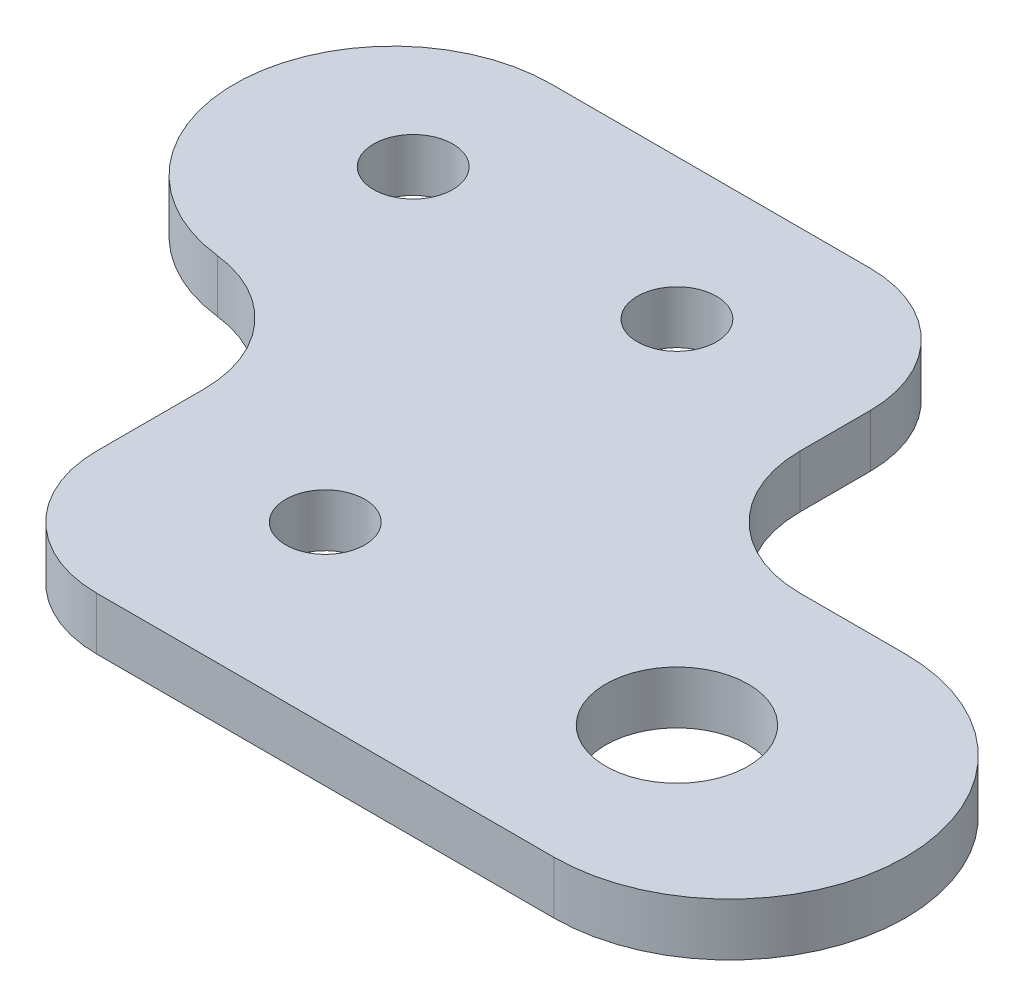
ISO-10303-21;
HEADER;
FILE_DESCRIPTION(('STEP AP214'),'2;1');
FILE_NAME('part.step','',(''),(''),'','','');
FILE_SCHEMA(('AUTOMOTIVE_DESIGN { 1 0 10303 214 1 1 1 1 }'));
ENDSEC;
DATA;
#1=APPLICATION_CONTEXT('core data for automotive mechanical design processes');
#2=APPLICATION_PROTOCOL_DEFINITION('international standard','automotive_design',2000,#1);
#3=PRODUCT_CONTEXT('',#1,'mechanical');
#4=PRODUCT('Part','Part','',(#3));
#5=PRODUCT_RELATED_PRODUCT_CATEGORY('part','',(#4));
#6=PRODUCT_DEFINITION_FORMATION('','',#4);
#7=PRODUCT_DEFINITION_CONTEXT('part definition',#1,'design');
#8=PRODUCT_DEFINITION('design','',#6,#7);
#9=PRODUCT_DEFINITION_SHAPE('','',#8);
#10=(LENGTH_UNIT() NAMED_UNIT(*) SI_UNIT(.MILLI.,.METRE.));
#11=(NAMED_UNIT(*) PLANE_ANGLE_UNIT() SI_UNIT($,.RADIAN.));
#12=(NAMED_UNIT(*) SI_UNIT($,.STERADIAN.) SOLID_ANGLE_UNIT());
#13=UNCERTAINTY_MEASURE_WITH_UNIT(LENGTH_MEASURE(1.E-05),#10,'distance_accuracy_value','');
#14=(GEOMETRIC_REPRESENTATION_CONTEXT(3) GLOBAL_UNCERTAINTY_ASSIGNED_CONTEXT((#13)) GLOBAL_UNIT_ASSIGNED_CONTEXT((#10,
#11,#12)) REPRESENTATION_CONTEXT('',''));
#15=CARTESIAN_POINT('',(0.,0.,0.));
#16=DIRECTION('',(0.,0.,1.));
#17=DIRECTION('',(1.,0.,0.));
#18=AXIS2_PLACEMENT_3D('',#15,#16,#17);
#19=CARTESIAN_POINT('',(6.500000000005,-1.500057886007,13.));
#20=DIRECTION('',(0.,-1.,0.));
#21=DIRECTION('',(0.,0.,-1.));
#22=AXIS2_PLACEMENT_3D('',#19,#20,#21);
#23=PLANE('',#22);
#24=CARTESIAN_POINT('',(16.,-1.500057886007,13.));
#25=DIRECTION('',(0.,-1.,0.));
#26=DIRECTION('',(0.,0.,-1.));
#27=AXIS2_PLACEMENT_3D('',#24,#25,#26);
#28=CIRCLE('',#27,4.05);
#29=CARTESIAN_POINT('',(16.,-1.500057886007,8.95));
#30=VERTEX_POINT('',#29);
#31=EDGE_CURVE('E166',#30,#30,#28,.T.);
#32=ORIENTED_EDGE('',*,*,#31,.T.);
#33=EDGE_LOOP('',(#32));
#34=FACE_BOUND('',#33,.T.);
#35=CARTESIAN_POINT('',(-19.,-1.500057886007,-7.));
#36=DIRECTION('',(0.,-1.,0.));
#37=DIRECTION('',(0.,0.,-1.));
#38=AXIS2_PLACEMENT_3D('',#35,#36,#37);
#39=CIRCLE('',#38,2.25);
#40=CARTESIAN_POINT('',(-19.,-1.500057886007,-9.25));
#41=VERTEX_POINT('',#40);
#42=EDGE_CURVE('E169',#41,#41,#39,.T.);
#43=ORIENTED_EDGE('',*,*,#42,.T.);
#44=EDGE_LOOP('',(#43));
#45=FACE_BOUND('',#44,.T.);
#46=CARTESIAN_POINT('',(-3.999999999995,-1.500057886007,13.));
#47=DIRECTION('',(0.,-1.,0.));
#48=DIRECTION('',(0.,0.,-1.));
#49=AXIS2_PLACEMENT_3D('',#46,#47,#48);
#50=CIRCLE('',#49,2.25);
#51=CARTESIAN_POINT('',(-3.999999999995,-1.500057886007,10.75));
#52=VERTEX_POINT('',#51);
#53=EDGE_CURVE('E172',#52,#52,#50,.T.);
#54=ORIENTED_EDGE('',*,*,#53,.T.);
#55=EDGE_LOOP('',(#54));
#56=FACE_BOUND('',#55,.T.);
#57=CARTESIAN_POINT('',(-3.999999999995,-1.500057886007,-7.));
#58=DIRECTION('',(0.,-1.,0.));
#59=DIRECTION('',(0.,0.,-1.));
#60=AXIS2_PLACEMENT_3D('',#57,#58,#59);
#61=CIRCLE('',#60,2.25);
#62=CARTESIAN_POINT('',(-3.999999999995,-1.500057886007,-9.25));
#63=VERTEX_POINT('',#62);
#64=EDGE_CURVE('E124',#63,#63,#61,.T.);
#65=ORIENTED_EDGE('',*,*,#64,.T.);
#66=EDGE_LOOP('',(#65));
#67=FACE_BOUND('',#66,.T.);
#68=CARTESIAN_POINT('',(-21.,-1.500057886007,9.893847866392));
#69=DIRECTION('',(0.,1.,0.));
#70=DIRECTION('',(0.,0.,1.));
#71=AXIS2_PLACEMENT_3D('',#68,#69,#70);
#72=CIRCLE('',#71,7.);
#73=CARTESIAN_POINT('',(-20.195000000025,-1.500057886007,2.94028942484258));
#74=VERTEX_POINT('',#73);
#75=CARTESIAN_POINT('',(-13.999999999995,-1.500057886007,9.893847866392));
#76=VERTEX_POINT('',#75);
#77=EDGE_CURVE('E132',#74,#76,#72,.F.);
#78=ORIENTED_EDGE('',*,*,#77,.T.);
#79=DIRECTION('',(0.,0.,1.));
#80=VECTOR('',#79,1.);
#81=CARTESIAN_POINT('',(-13.99999999999,-1.500057886007,23.));
#82=LINE('',#81,#80);
#83=CARTESIAN_POINT('',(-13.99999999999,-1.500057886007,16.));
#84=VERTEX_POINT('',#83);
#85=EDGE_CURVE('E129',#84,#76,#82,.F.);
#86=ORIENTED_EDGE('',*,*,#85,.F.);
#87=CARTESIAN_POINT('',(-6.999999999995,-1.500057886007,16.));
#88=DIRECTION('',(0.,1.,0.));
#89=DIRECTION('',(0.,0.,1.));
#90=AXIS2_PLACEMENT_3D('',#87,#88,#89);
#91=CIRCLE('',#90,7.);
#92=CARTESIAN_POINT('',(-6.999999999995,-1.500057886007,23.));
#93=VERTEX_POINT('',#92);
#94=EDGE_CURVE('E186',#93,#84,#91,.F.);
#95=ORIENTED_EDGE('',*,*,#94,.F.);
#96=DIRECTION('',(1.,0.,0.));
#97=VECTOR('',#96,1.);
#98=CARTESIAN_POINT('',(29.,-1.500057886007,23.));
#99=LINE('',#98,#97);
#100=CARTESIAN_POINT('',(19.,-1.500057886007,23.));
#101=VERTEX_POINT('',#100);
#102=EDGE_CURVE('E134',#101,#93,#99,.F.);
#103=ORIENTED_EDGE('',*,*,#102,.F.);
#104=CARTESIAN_POINT('',(19.,-1.500057886007,13.));
#105=DIRECTION('',(0.,-1.,0.));
#106=DIRECTION('',(0.,0.,-1.));
#107=AXIS2_PLACEMENT_3D('',#104,#105,#106);
#108=CIRCLE('',#107,10.);
#109=CARTESIAN_POINT('',(19.,-1.500057886007,3.));
#110=VERTEX_POINT('',#109);
#111=EDGE_CURVE('E109',#110,#101,#108,.T.);
#112=ORIENTED_EDGE('',*,*,#111,.F.);
#113=DIRECTION('',(-1.,0.,0.));
#114=VECTOR('',#113,1.);
#115=CARTESIAN_POINT('',(-15.99999999999,-1.500057886007,3.));
#116=LINE('',#115,#114);
#117=CARTESIAN_POINT('',(13.000000000005,-1.500057886007,3.));
#118=VERTEX_POINT('',#117);
#119=EDGE_CURVE('E107',#118,#110,#116,.F.);
#120=ORIENTED_EDGE('',*,*,#119,.F.);
#121=CARTESIAN_POINT('',(13.00000000001,-1.500057886007,-4.));
#122=DIRECTION('',(0.,-1.,0.));
#123=DIRECTION('',(0.,0.,-1.));
#124=AXIS2_PLACEMENT_3D('',#121,#122,#123);
#125=CIRCLE('',#124,7.);
#126=CARTESIAN_POINT('',(6.000000000005,-1.500057886007,-4.));
#127=VERTEX_POINT('',#126);
#128=EDGE_CURVE('E19',#118,#127,#125,.T.);
#129=ORIENTED_EDGE('',*,*,#128,.T.);
#130=DIRECTION('',(0.,0.,-1.));
#131=VECTOR('',#130,1.);
#132=CARTESIAN_POINT('',(6.000000000005,-1.500057886007,-17.));
#133=LINE('',#132,#131);
#134=CARTESIAN_POINT('',(6.000000000005,-1.500057886007,-8.));
#135=VERTEX_POINT('',#134);
#136=EDGE_CURVE('E122',#135,#127,#133,.F.);
#137=ORIENTED_EDGE('',*,*,#136,.F.);
#138=CARTESIAN_POINT('',(-0.999999999995,-1.500057886007,-8.));
#139=DIRECTION('',(0.,1.,0.));
#140=DIRECTION('',(0.,0.,1.));
#141=AXIS2_PLACEMENT_3D('',#138,#139,#140);
#142=CIRCLE('',#141,7.);
#143=CARTESIAN_POINT('',(-0.999999999994999,-1.500057886007,-15.));
#144=VERTEX_POINT('',#143);
#145=EDGE_CURVE('E177',#144,#135,#142,.F.);
#146=ORIENTED_EDGE('',*,*,#145,.F.);
#147=DIRECTION('',(-1.,0.,0.));
#148=VECTOR('',#147,1.);
#149=CARTESIAN_POINT('',(-28.16,-1.500057886007,-15.));
#150=LINE('',#149,#148);
#151=CARTESIAN_POINT('',(-19.159999999995,-1.500057886007,-15.));
#152=VERTEX_POINT('',#151);
#153=EDGE_CURVE('E125',#152,#144,#150,.F.);
#154=ORIENTED_EDGE('',*,*,#153,.F.);
#155=CARTESIAN_POINT('',(-19.16,-1.500057886007,-6.));
#156=DIRECTION('',(0.,-1.,0.));
#157=DIRECTION('',(0.,0.,-1.));
#158=AXIS2_PLACEMENT_3D('',#155,#156,#157);
#159=CIRCLE('',#158,9.);
#160=EDGE_CURVE('E181',#74,#152,#159,.T.);
#161=ORIENTED_EDGE('',*,*,#160,.F.);
#162=EDGE_LOOP('',(#78,#86,#95,#103,#112,#120,#129,#137,#146,#154,#161));
#163=FACE_BOUND('',#162,.T.);
#164=ADVANCED_FACE('F16',(#34,#45,#56,#67,#163),#23,.F.);
#165=CARTESIAN_POINT('',(13.00000000001,7.422742113993,-4.));
#166=DIRECTION('',(0.,-1.,0.));
#167=DIRECTION('',(0.,0.,-1.));
#168=AXIS2_PLACEMENT_3D('',#165,#166,#167);
#169=CYLINDRICAL_SURFACE('',#168,7.);
#170=ORIENTED_EDGE('',*,*,#128,.F.);
#171=DIRECTION('',(0.,1.,0.));
#172=VECTOR('',#171,1.);
#173=CARTESIAN_POINT('',(13.,-1.500057886007,3.));
#174=LINE('',#173,#172);
#175=CARTESIAN_POINT('',(13.000000000005,-4.500057886007,3.));
#176=VERTEX_POINT('',#175);
#177=EDGE_CURVE('E99',#176,#118,#174,.T.);
#178=ORIENTED_EDGE('',*,*,#177,.F.);
#179=CARTESIAN_POINT('',(13.00000000001,-4.500057886007,-4.));
#180=DIRECTION('',(0.,-1.,0.));
#181=DIRECTION('',(0.,0.,-1.));
#182=AXIS2_PLACEMENT_3D('',#179,#180,#181);
#183=CIRCLE('',#182,7.);
#184=CARTESIAN_POINT('',(6.000000000005,-4.500057886007,-4.));
#185=VERTEX_POINT('',#184);
#186=EDGE_CURVE('E164',#185,#176,#183,.F.);
#187=ORIENTED_EDGE('',*,*,#186,.F.);
#188=DIRECTION('',(0.,1.,0.));
#189=VECTOR('',#188,1.);
#190=CARTESIAN_POINT('',(6.000000000005,-6.500057886007,-4.));
#191=LINE('',#190,#189);
#192=EDGE_CURVE('E102',#127,#185,#191,.F.);
#193=ORIENTED_EDGE('',*,*,#192,.F.);
#194=EDGE_LOOP('',(#170,#178,#187,#193));
#195=FACE_BOUND('',#194,.T.);
#196=ADVANCED_FACE('F97',(#195),#169,.F.);
#197=CARTESIAN_POINT('',(-15.99999999999,-1.500057886007,3.));
#198=DIRECTION('',(0.,0.,-1.));
#199=DIRECTION('',(-1.,0.,0.));
#200=AXIS2_PLACEMENT_3D('',#197,#198,#199);
#201=PLANE('',#200);
#202=ORIENTED_EDGE('',*,*,#177,.T.);
#203=ORIENTED_EDGE('',*,*,#119,.T.);
#204=DIRECTION('',(0.,1.,0.));
#205=VECTOR('',#204,1.);
#206=CARTESIAN_POINT('',(19.,-1.500057886007,3.));
#207=LINE('',#206,#205);
#208=CARTESIAN_POINT('',(19.,-4.500057886007,3.));
#209=VERTEX_POINT('',#208);
#210=EDGE_CURVE('E188',#209,#110,#207,.T.);
#211=ORIENTED_EDGE('',*,*,#210,.F.);
#212=DIRECTION('',(1.,0.,0.));
#213=VECTOR('',#212,1.);
#214=CARTESIAN_POINT('',(6.500000000005,-4.500057886007,3.));
#215=LINE('',#214,#213);
#216=EDGE_CURVE('E115',#176,#209,#215,.T.);
#217=ORIENTED_EDGE('',*,*,#216,.F.);
#218=EDGE_LOOP('',(#202,#203,#211,#217));
#219=FACE_BOUND('',#218,.T.);
#220=ADVANCED_FACE('F113',(#219),#201,.T.);
#221=CARTESIAN_POINT('',(19.,5.017942113993,13.));
#222=DIRECTION('',(0.,-1.,0.));
#223=DIRECTION('',(0.,0.,-1.));
#224=AXIS2_PLACEMENT_3D('',#221,#222,#223);
#225=CYLINDRICAL_SURFACE('',#224,10.);
#226=CARTESIAN_POINT('',(19.,-4.500057886007,13.));
#227=DIRECTION('',(0.,-1.,0.));
#228=DIRECTION('',(0.,0.,-1.));
#229=AXIS2_PLACEMENT_3D('',#226,#227,#228);
#230=CIRCLE('',#229,10.);
#231=CARTESIAN_POINT('',(19.,-4.500057886007,23.));
#232=VERTEX_POINT('',#231);
#233=EDGE_CURVE('E161',#209,#232,#230,.T.);
#234=ORIENTED_EDGE('',*,*,#233,.F.);
#235=ORIENTED_EDGE('',*,*,#210,.T.);
#236=ORIENTED_EDGE('',*,*,#111,.T.);
#237=DIRECTION('',(0.,1.,0.));
#238=VECTOR('',#237,1.);
#239=CARTESIAN_POINT('',(19.,-1.500057886007,23.));
#240=LINE('',#239,#238);
#241=EDGE_CURVE('E120',#232,#101,#240,.T.);
#242=ORIENTED_EDGE('',*,*,#241,.F.);
#243=EDGE_LOOP('',(#234,#235,#236,#242));
#244=FACE_BOUND('',#243,.T.);
#245=ADVANCED_FACE('F191',(#244),#225,.T.);
#246=CARTESIAN_POINT('',(29.,-1.500057886007,23.));
#247=DIRECTION('',(0.,0.,1.));
#248=DIRECTION('',(1.,0.,0.));
#249=AXIS2_PLACEMENT_3D('',#246,#247,#248);
#250=PLANE('',#249);
#251=DIRECTION('',(0.,1.,0.));
#252=VECTOR('',#251,1.);
#253=CARTESIAN_POINT('',(-6.999999999995,-15.42285788601,23.));
#254=LINE('',#253,#252);
#255=CARTESIAN_POINT('',(-6.999999999995,-4.500057886007,23.));
#256=VERTEX_POINT('',#255);
#257=EDGE_CURVE('E135',#256,#93,#254,.T.);
#258=ORIENTED_EDGE('',*,*,#257,.F.);
#259=DIRECTION('',(1.,0.,0.));
#260=VECTOR('',#259,1.);
#261=CARTESIAN_POINT('',(6.500000000005,-4.500057886007,23.));
#262=LINE('',#261,#260);
#263=EDGE_CURVE('E160',#232,#256,#262,.F.);
#264=ORIENTED_EDGE('',*,*,#263,.F.);
#265=ORIENTED_EDGE('',*,*,#241,.T.);
#266=ORIENTED_EDGE('',*,*,#102,.T.);
#267=EDGE_LOOP('',(#258,#264,#265,#266));
#268=FACE_BOUND('',#267,.T.);
#269=ADVANCED_FACE('F198',(#268),#250,.T.);
#270=CARTESIAN_POINT('',(-6.999999999995,-15.42285788601,16.));
#271=DIRECTION('',(0.,1.,0.));
#272=DIRECTION('',(0.,0.,1.));
#273=AXIS2_PLACEMENT_3D('',#270,#271,#272);
#274=CYLINDRICAL_SURFACE('',#273,7.);
#275=ORIENTED_EDGE('',*,*,#94,.T.);
#276=DIRECTION('',(0.,1.,0.));
#277=VECTOR('',#276,1.);
#278=CARTESIAN_POINT('',(-13.99999999999,-1.500057886007,16.));
#279=LINE('',#278,#277);
#280=CARTESIAN_POINT('',(-13.999999999995,-4.500057886007,16.));
#281=VERTEX_POINT('',#280);
#282=EDGE_CURVE('E133',#281,#84,#279,.T.);
#283=ORIENTED_EDGE('',*,*,#282,.F.);
#284=CARTESIAN_POINT('',(-6.999999999995,-4.500057886007,16.));
#285=DIRECTION('',(0.,1.,0.));
#286=DIRECTION('',(0.,0.,1.));
#287=AXIS2_PLACEMENT_3D('',#284,#285,#286);
#288=CIRCLE('',#287,7.);
#289=EDGE_CURVE('E157',#256,#281,#288,.F.);
#290=ORIENTED_EDGE('',*,*,#289,.F.);
#291=ORIENTED_EDGE('',*,*,#257,.T.);
#292=EDGE_LOOP('',(#275,#283,#290,#291));
#293=FACE_BOUND('',#292,.T.);
#294=ADVANCED_FACE('F217',(#293),#274,.T.);
#295=CARTESIAN_POINT('',(-13.99999999999,-1.500057886007,23.));
#296=DIRECTION('',(-1.,0.,0.));
#297=DIRECTION('',(0.,0.,1.));
#298=AXIS2_PLACEMENT_3D('',#295,#296,#297);
#299=PLANE('',#298);
#300=ORIENTED_EDGE('',*,*,#282,.T.);
#301=ORIENTED_EDGE('',*,*,#85,.T.);
#302=DIRECTION('',(0.,1.,0.));
#303=VECTOR('',#302,1.);
#304=CARTESIAN_POINT('',(-14.,-15.42285788601,9.893847866392));
#305=LINE('',#304,#303);
#306=CARTESIAN_POINT('',(-14.,-4.500057886007,9.893847866392));
#307=VERTEX_POINT('',#306);
#308=EDGE_CURVE('E185',#76,#307,#305,.F.);
#309=ORIENTED_EDGE('',*,*,#308,.T.);
#310=DIRECTION('',(0.,0.,-1.));
#311=VECTOR('',#310,1.);
#312=CARTESIAN_POINT('',(-14.,-4.500057886007,13.));
#313=LINE('',#312,#311);
#314=EDGE_CURVE('E156',#281,#307,#313,.T.);
#315=ORIENTED_EDGE('',*,*,#314,.F.);
#316=EDGE_LOOP('',(#300,#301,#309,#315));
#317=FACE_BOUND('',#316,.T.);
#318=ADVANCED_FACE('F239',(#317),#299,.T.);
#319=CARTESIAN_POINT('',(-21.,-15.42285788601,9.893847866392));
#320=DIRECTION('',(0.,1.,0.));
#321=DIRECTION('',(0.,0.,1.));
#322=AXIS2_PLACEMENT_3D('',#319,#320,#321);
#323=CYLINDRICAL_SURFACE('',#322,7.);
#324=CARTESIAN_POINT('',(-21.,-4.500057886007,9.893847866392));
#325=DIRECTION('',(0.,1.,0.));
#326=DIRECTION('',(0.,0.,1.));
#327=AXIS2_PLACEMENT_3D('',#324,#325,#326);
#328=CIRCLE('',#327,7.);
#329=CARTESIAN_POINT('',(-20.195000000025,-4.500057886007,2.94028942484237));
#330=VERTEX_POINT('',#329);
#331=EDGE_CURVE('E153',#307,#330,#328,.T.);
#332=ORIENTED_EDGE('',*,*,#331,.F.);
#333=ORIENTED_EDGE('',*,*,#308,.F.);
#334=ORIENTED_EDGE('',*,*,#77,.F.);
#335=DIRECTION('',(0.,-1.,0.));
#336=VECTOR('',#335,1.);
#337=CARTESIAN_POINT('',(-20.1950000000499,5.017942113993,2.94028942483948));
#338=LINE('',#337,#336);
#339=EDGE_CURVE('E183',#330,#74,#338,.F.);
#340=ORIENTED_EDGE('',*,*,#339,.F.);
#341=EDGE_LOOP('',(#332,#333,#334,#340));
#342=FACE_BOUND('',#341,.T.);
#343=ADVANCED_FACE('F240',(#342),#323,.F.);
#344=CARTESIAN_POINT('',(-19.16,5.017942113993,-6.));
#345=DIRECTION('',(0.,-1.,0.));
#346=DIRECTION('',(0.,0.,-1.));
#347=AXIS2_PLACEMENT_3D('',#344,#345,#346);
#348=CYLINDRICAL_SURFACE('',#347,9.);
#349=ORIENTED_EDGE('',*,*,#339,.T.);
#350=ORIENTED_EDGE('',*,*,#160,.T.);
#351=DIRECTION('',(0.,1.,0.));
#352=VECTOR('',#351,1.);
#353=CARTESIAN_POINT('',(-19.15999999999,-6.500057886007,-15.));
#354=LINE('',#353,#352);
#355=CARTESIAN_POINT('',(-19.159999999995,-4.500057886007,-15.));
#356=VERTEX_POINT('',#355);
#357=EDGE_CURVE('E128',#356,#152,#354,.T.);
#358=ORIENTED_EDGE('',*,*,#357,.F.);
#359=CARTESIAN_POINT('',(-19.16,-4.500057886007,-6.));
#360=DIRECTION('',(0.,-1.,0.));
#361=DIRECTION('',(0.,0.,-1.));
#362=AXIS2_PLACEMENT_3D('',#359,#360,#361);
#363=CIRCLE('',#362,9.);
#364=EDGE_CURVE('E150',#330,#356,#363,.T.);
#365=ORIENTED_EDGE('',*,*,#364,.F.);
#366=EDGE_LOOP('',(#349,#350,#358,#365));
#367=FACE_BOUND('',#366,.T.);
#368=ADVANCED_FACE('F236',(#367),#348,.T.);
#369=CARTESIAN_POINT('',(-28.16,-6.500057886007,-15.));
#370=DIRECTION('',(0.,0.,-1.));
#371=DIRECTION('',(-1.,0.,0.));
#372=AXIS2_PLACEMENT_3D('',#369,#370,#371);
#373=PLANE('',#372);
#374=DIRECTION('',(0.,1.,0.));
#375=VECTOR('',#374,1.);
#376=CARTESIAN_POINT('',(-0.999999999994999,-15.42285788601,-15.));
#377=LINE('',#376,#375);
#378=CARTESIAN_POINT('',(-0.999999999995,-4.500057886007,-15.));
#379=VERTEX_POINT('',#378);
#380=EDGE_CURVE('E127',#379,#144,#377,.T.);
#381=ORIENTED_EDGE('',*,*,#380,.F.);
#382=DIRECTION('',(1.,0.,0.));
#383=VECTOR('',#382,1.);
#384=CARTESIAN_POINT('',(6.500000000005,-4.500057886007,-15.));
#385=LINE('',#384,#383);
#386=EDGE_CURVE('E149',#356,#379,#385,.T.);
#387=ORIENTED_EDGE('',*,*,#386,.F.);
#388=ORIENTED_EDGE('',*,*,#357,.T.);
#389=ORIENTED_EDGE('',*,*,#153,.T.);
#390=EDGE_LOOP('',(#381,#387,#388,#389));
#391=FACE_BOUND('',#390,.T.);
#392=ADVANCED_FACE('F233',(#391),#373,.T.);
#393=CARTESIAN_POINT('',(-0.999999999995,-15.42285788601,-8.));
#394=DIRECTION('',(0.,1.,0.));
#395=DIRECTION('',(0.,0.,1.));
#396=AXIS2_PLACEMENT_3D('',#393,#394,#395);
#397=CYLINDRICAL_SURFACE('',#396,7.);
#398=ORIENTED_EDGE('',*,*,#145,.T.);
#399=DIRECTION('',(0.,1.,0.));
#400=VECTOR('',#399,1.);
#401=CARTESIAN_POINT('',(6.000000000005,-6.500057886007,-8.));
#402=LINE('',#401,#400);
#403=CARTESIAN_POINT('',(6.000000000005,-4.500057886007,-8.));
#404=VERTEX_POINT('',#403);
#405=EDGE_CURVE('E34',#404,#135,#402,.T.);
#406=ORIENTED_EDGE('',*,*,#405,.F.);
#407=CARTESIAN_POINT('',(-0.999999999995,-4.500057886007,-8.));
#408=DIRECTION('',(0.,1.,0.));
#409=DIRECTION('',(0.,0.,1.));
#410=AXIS2_PLACEMENT_3D('',#407,#408,#409);
#411=CIRCLE('',#410,7.);
#412=EDGE_CURVE('E146',#379,#404,#411,.F.);
#413=ORIENTED_EDGE('',*,*,#412,.F.);
#414=ORIENTED_EDGE('',*,*,#380,.T.);
#415=EDGE_LOOP('',(#398,#406,#413,#414));
#416=FACE_BOUND('',#415,.T.);
#417=ADVANCED_FACE('F230',(#416),#397,.T.);
#418=CARTESIAN_POINT('',(6.000000000005,-6.500057886007,-17.));
#419=DIRECTION('',(1.,0.,0.));
#420=DIRECTION('',(0.,0.,-1.));
#421=AXIS2_PLACEMENT_3D('',#418,#419,#420);
#422=PLANE('',#421);
#423=ORIENTED_EDGE('',*,*,#405,.T.);
#424=ORIENTED_EDGE('',*,*,#136,.T.);
#425=ORIENTED_EDGE('',*,*,#192,.T.);
#426=DIRECTION('',(0.,0.,-1.));
#427=VECTOR('',#426,1.);
#428=CARTESIAN_POINT('',(6.000000000005,-4.500057886007,13.));
#429=LINE('',#428,#427);
#430=EDGE_CURVE('E145',#404,#185,#429,.F.);
#431=ORIENTED_EDGE('',*,*,#430,.F.);
#432=EDGE_LOOP('',(#423,#424,#425,#431));
#433=FACE_BOUND('',#432,.T.);
#434=ADVANCED_FACE('F226',(#433),#422,.T.);
#435=CARTESIAN_POINT('',(-3.999999999995,-6.500057886007,-7.));
#436=DIRECTION('',(0.,-1.,0.));
#437=DIRECTION('',(0.,0.,-1.));
#438=AXIS2_PLACEMENT_3D('',#435,#436,#437);
#439=CYLINDRICAL_SURFACE('',#438,2.25);
#440=CARTESIAN_POINT('',(-3.999999999995,-4.500057886007,-7.));
#441=DIRECTION('',(0.,-1.,0.));
#442=DIRECTION('',(0.,0.,-1.));
#443=AXIS2_PLACEMENT_3D('',#440,#441,#442);
#444=CIRCLE('',#443,2.25);
#445=CARTESIAN_POINT('',(-3.999999999995,-4.500057886007,-9.25));
#446=VERTEX_POINT('',#445);
#447=EDGE_CURVE('E142',#446,#446,#444,.F.);
#448=ORIENTED_EDGE('',*,*,#447,.F.);
#449=EDGE_LOOP('',(#448));
#450=FACE_BOUND('',#449,.T.);
#451=ORIENTED_EDGE('',*,*,#64,.F.);
#452=EDGE_LOOP('',(#451));
#453=FACE_BOUND('',#452,.T.);
#454=ADVANCED_FACE('F268',(#450,#453),#439,.F.);
#455=CARTESIAN_POINT('',(-3.999999999995,-1.500057886007,13.));
#456=DIRECTION('',(0.,-1.,0.));
#457=DIRECTION('',(0.,0.,-1.));
#458=AXIS2_PLACEMENT_3D('',#455,#456,#457);
#459=CYLINDRICAL_SURFACE('',#458,2.25);
#460=CARTESIAN_POINT('',(-3.999999999995,-4.500057886007,13.));
#461=DIRECTION('',(0.,-1.,0.));
#462=DIRECTION('',(0.,0.,-1.));
#463=AXIS2_PLACEMENT_3D('',#460,#461,#462);
#464=CIRCLE('',#463,2.25);
#465=CARTESIAN_POINT('',(-3.999999999995,-4.500057886007,10.75));
#466=VERTEX_POINT('',#465);
#467=EDGE_CURVE('E139',#466,#466,#464,.F.);
#468=ORIENTED_EDGE('',*,*,#467,.F.);
#469=EDGE_LOOP('',(#468));
#470=FACE_BOUND('',#469,.T.);
#471=ORIENTED_EDGE('',*,*,#53,.F.);
#472=EDGE_LOOP('',(#471));
#473=FACE_BOUND('',#472,.T.);
#474=ADVANCED_FACE('F264',(#470,#473),#459,.F.);
#475=CARTESIAN_POINT('',(-19.,-6.500057886007,-7.));
#476=DIRECTION('',(0.,-1.,0.));
#477=DIRECTION('',(0.,0.,-1.));
#478=AXIS2_PLACEMENT_3D('',#475,#476,#477);
#479=CYLINDRICAL_SURFACE('',#478,2.25);
#480=CARTESIAN_POINT('',(-19.,-4.500057886007,-7.));
#481=DIRECTION('',(0.,-1.,0.));
#482=DIRECTION('',(0.,0.,-1.));
#483=AXIS2_PLACEMENT_3D('',#480,#481,#482);
#484=CIRCLE('',#483,2.25);
#485=CARTESIAN_POINT('',(-19.,-4.500057886007,-9.25));
#486=VERTEX_POINT('',#485);
#487=EDGE_CURVE('E25',#486,#486,#484,.F.);
#488=ORIENTED_EDGE('',*,*,#487,.F.);
#489=EDGE_LOOP('',(#488));
#490=FACE_BOUND('',#489,.T.);
#491=ORIENTED_EDGE('',*,*,#42,.F.);
#492=EDGE_LOOP('',(#491));
#493=FACE_BOUND('',#492,.T.);
#494=ADVANCED_FACE('F257',(#490,#493),#479,.F.);
#495=CARTESIAN_POINT('',(16.,-6.500057886007,13.));
#496=DIRECTION('',(0.,-1.,0.));
#497=DIRECTION('',(0.,0.,-1.));
#498=AXIS2_PLACEMENT_3D('',#495,#496,#497);
#499=CYLINDRICAL_SURFACE('',#498,4.05);
#500=ORIENTED_EDGE('',*,*,#31,.F.);
#501=EDGE_LOOP('',(#500));
#502=FACE_BOUND('',#501,.T.);
#503=CARTESIAN_POINT('',(16.,-4.500057886007,13.));
#504=DIRECTION('',(0.,-1.,0.));
#505=DIRECTION('',(0.,0.,-1.));
#506=AXIS2_PLACEMENT_3D('',#503,#504,#505);
#507=CIRCLE('',#506,4.05);
#508=CARTESIAN_POINT('',(16.,-4.500057886007,8.95));
#509=VERTEX_POINT('',#508);
#510=EDGE_CURVE('E11',#509,#509,#507,.F.);
#511=ORIENTED_EDGE('',*,*,#510,.F.);
#512=EDGE_LOOP('',(#511));
#513=FACE_BOUND('',#512,.T.);
#514=ADVANCED_FACE('F251',(#502,#513),#499,.F.);
#515=CARTESIAN_POINT('',(6.500000000005,-4.500057886007,13.));
#516=DIRECTION('',(0.,-1.,0.));
#517=DIRECTION('',(0.,0.,-1.));
#518=AXIS2_PLACEMENT_3D('',#515,#516,#517);
#519=PLANE('',#518);
#520=ORIENTED_EDGE('',*,*,#510,.T.);
#521=EDGE_LOOP('',(#520));
#522=FACE_BOUND('',#521,.T.);
#523=ORIENTED_EDGE('',*,*,#487,.T.);
#524=EDGE_LOOP('',(#523));
#525=FACE_BOUND('',#524,.T.);
#526=ORIENTED_EDGE('',*,*,#467,.T.);
#527=EDGE_LOOP('',(#526));
#528=FACE_BOUND('',#527,.T.);
#529=ORIENTED_EDGE('',*,*,#447,.T.);
#530=EDGE_LOOP('',(#529));
#531=FACE_BOUND('',#530,.T.);
#532=ORIENTED_EDGE('',*,*,#412,.T.);
#533=ORIENTED_EDGE('',*,*,#430,.T.);
#534=ORIENTED_EDGE('',*,*,#186,.T.);
#535=ORIENTED_EDGE('',*,*,#216,.T.);
#536=ORIENTED_EDGE('',*,*,#233,.T.);
#537=ORIENTED_EDGE('',*,*,#263,.T.);
#538=ORIENTED_EDGE('',*,*,#289,.T.);
#539=ORIENTED_EDGE('',*,*,#314,.T.);
#540=ORIENTED_EDGE('',*,*,#331,.T.);
#541=ORIENTED_EDGE('',*,*,#364,.T.);
#542=ORIENTED_EDGE('',*,*,#386,.T.);
#543=EDGE_LOOP('',(#532,#533,#534,#535,#536,#537,#538,#539,#540,#541,#542));
#544=FACE_BOUND('',#543,.T.);
#545=ADVANCED_FACE('F203',(#522,#525,#528,#531,#544),#519,.T.);
#546=CLOSED_SHELL('',(#164,#196,#220,#245,#269,#294,#318,#343,#368,#392,#417,#434,#454,#474,
#494,#514,#545));
#547=MANIFOLD_SOLID_BREP('B1',#546);
#548=ADVANCED_BREP_SHAPE_REPRESENTATION('',(#18,#547),#14);
#549=SHAPE_DEFINITION_REPRESENTATION(#9,#548);
ENDSEC;
END-ISO-10303-21;
